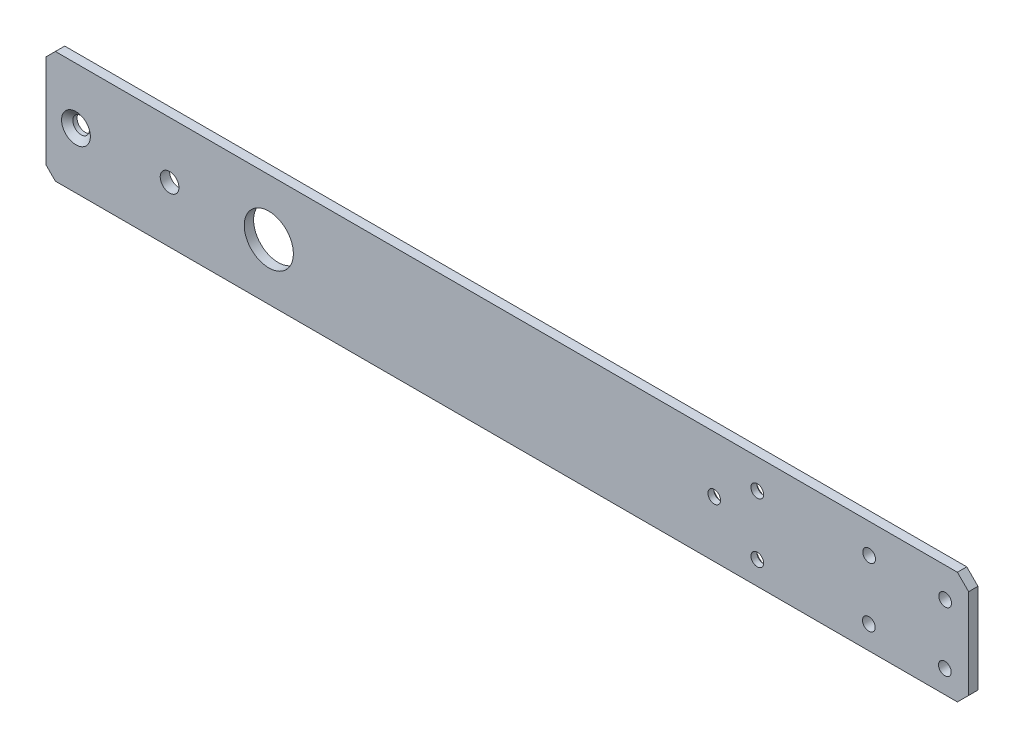
ISO-10303-21;
HEADER;
FILE_DESCRIPTION(('STEP AP214'),'2;1');
FILE_NAME('part.step','',(''),(''),'','','');
FILE_SCHEMA(('AUTOMOTIVE_DESIGN { 1 0 10303 214 1 1 1 1 }'));
ENDSEC;
DATA;
#1=APPLICATION_CONTEXT('core data for automotive mechanical design processes');
#2=APPLICATION_PROTOCOL_DEFINITION('international standard','automotive_design',2000,#1);
#3=PRODUCT_CONTEXT('',#1,'mechanical');
#4=PRODUCT('Part','Part','',(#3));
#5=PRODUCT_RELATED_PRODUCT_CATEGORY('part','',(#4));
#6=PRODUCT_DEFINITION_FORMATION('','',#4);
#7=PRODUCT_DEFINITION_CONTEXT('part definition',#1,'design');
#8=PRODUCT_DEFINITION('design','',#6,#7);
#9=PRODUCT_DEFINITION_SHAPE('','',#8);
#10=(LENGTH_UNIT() NAMED_UNIT(*) SI_UNIT(.MILLI.,.METRE.));
#11=(NAMED_UNIT(*) PLANE_ANGLE_UNIT() SI_UNIT($,.RADIAN.));
#12=(NAMED_UNIT(*) SI_UNIT($,.STERADIAN.) SOLID_ANGLE_UNIT());
#13=UNCERTAINTY_MEASURE_WITH_UNIT(LENGTH_MEASURE(1.E-05),#10,'distance_accuracy_value','');
#14=(GEOMETRIC_REPRESENTATION_CONTEXT(3) GLOBAL_UNCERTAINTY_ASSIGNED_CONTEXT((#13)) GLOBAL_UNIT_ASSIGNED_CONTEXT((#10,
#11,#12)) REPRESENTATION_CONTEXT('',''));
#15=CARTESIAN_POINT('',(0.,0.,0.));
#16=DIRECTION('',(0.,0.,1.));
#17=DIRECTION('',(1.,0.,0.));
#18=AXIS2_PLACEMENT_3D('',#15,#16,#17);
#19=CARTESIAN_POINT('',(0.,0.,1.5875));
#20=DIRECTION('',(0.,0.,-1.));
#21=DIRECTION('',(-1.,0.,0.));
#22=AXIS2_PLACEMENT_3D('',#19,#20,#21);
#23=PLANE('',#22);
#24=CARTESIAN_POINT('',(-33.6549999999997,0.,1.5875));
#25=DIRECTION('',(0.,0.,1.));
#26=DIRECTION('',(1.,0.,0.));
#27=AXIS2_PLACEMENT_3D('',#24,#25,#26);
#28=CIRCLE('',#27,3.175);
#29=CARTESIAN_POINT('',(-30.4799999999997,0.,1.5875));
#30=VERTEX_POINT('',#29);
#31=EDGE_CURVE('E236',#30,#30,#28,.T.);
#32=ORIENTED_EDGE('',*,*,#31,.F.);
#33=EDGE_LOOP('',(#32));
#34=FACE_BOUND('',#33,.T.);
#35=CARTESIAN_POINT('',(-65.4049999999997,0.,1.5875));
#36=DIRECTION('',(0.,0.,1.));
#37=DIRECTION('',(1.,0.,0.));
#38=AXIS2_PLACEMENT_3D('',#35,#36,#37);
#39=CIRCLE('',#38,4.8895);
#40=CARTESIAN_POINT('',(-60.5154999999997,0.,1.5875));
#41=VERTEX_POINT('',#40);
#42=EDGE_CURVE('E230',#41,#41,#39,.T.);
#43=ORIENTED_EDGE('',*,*,#42,.F.);
#44=EDGE_LOOP('',(#43));
#45=FACE_BOUND('',#44,.T.);
#46=CARTESIAN_POINT('',(229.388701470581,8.92379178362501,1.5875));
#47=DIRECTION('',(0.,0.,1.));
#48=DIRECTION('',(1.,0.,0.));
#49=AXIS2_PLACEMENT_3D('',#46,#47,#48);
#50=CIRCLE('',#49,2.15265000000001);
#51=CARTESIAN_POINT('',(231.541351470581,8.92379178362501,1.5875));
#52=VERTEX_POINT('',#51);
#53=EDGE_CURVE('E217',#52,#52,#50,.T.);
#54=ORIENTED_EDGE('',*,*,#53,.F.);
#55=EDGE_LOOP('',(#54));
#56=FACE_BOUND('',#55,.T.);
#57=CARTESIAN_POINT('',(229.282371238552,-11.3467989682312,1.5875));
#58=DIRECTION('',(0.,0.,1.));
#59=DIRECTION('',(1.,0.,0.));
#60=AXIS2_PLACEMENT_3D('',#57,#58,#59);
#61=CIRCLE('',#60,2.15265000000001);
#62=CARTESIAN_POINT('',(231.435021238552,-11.3467989682312,1.5875));
#63=VERTEX_POINT('',#62);
#64=EDGE_CURVE('E211',#63,#63,#61,.T.);
#65=ORIENTED_EDGE('',*,*,#64,.F.);
#66=EDGE_LOOP('',(#65));
#67=FACE_BOUND('',#66,.T.);
#68=CARTESIAN_POINT('',(203.503161764145,-11.1439269688226,1.5875));
#69=DIRECTION('',(0.,0.,1.));
#70=DIRECTION('',(1.,0.,0.));
#71=AXIS2_PLACEMENT_3D('',#68,#69,#70);
#72=CIRCLE('',#71,2.15265000000001);
#73=CARTESIAN_POINT('',(205.655811764145,-11.1439269688226,1.5875));
#74=VERTEX_POINT('',#73);
#75=EDGE_CURVE('E205',#74,#74,#72,.T.);
#76=ORIENTED_EDGE('',*,*,#75,.F.);
#77=EDGE_LOOP('',(#76));
#78=FACE_BOUND('',#77,.T.);
#79=CARTESIAN_POINT('',(203.608782335042,8.99137535087546,1.5875));
#80=DIRECTION('',(0.,0.,1.));
#81=DIRECTION('',(1.,0.,0.));
#82=AXIS2_PLACEMENT_3D('',#79,#80,#81);
#83=CIRCLE('',#82,2.15265000000001);
#84=CARTESIAN_POINT('',(205.761432335042,8.99137535087546,1.5875));
#85=VERTEX_POINT('',#84);
#86=EDGE_CURVE('E199',#85,#85,#83,.T.);
#87=ORIENTED_EDGE('',*,*,#86,.F.);
#88=EDGE_LOOP('',(#87));
#89=FACE_BOUND('',#88,.T.);
#90=CARTESIAN_POINT('',(165.672159691472,8.99137535087546,1.5875));
#91=DIRECTION('',(0.,0.,1.));
#92=DIRECTION('',(1.,0.,0.));
#93=AXIS2_PLACEMENT_3D('',#90,#91,#92);
#94=CIRCLE('',#93,2.15265000000001);
#95=CARTESIAN_POINT('',(167.824809691472,8.99137535087546,1.5875));
#96=VERTEX_POINT('',#95);
#97=EDGE_CURVE('E192',#96,#96,#94,.T.);
#98=ORIENTED_EDGE('',*,*,#97,.F.);
#99=EDGE_LOOP('',(#98));
#100=FACE_BOUND('',#99,.T.);
#101=CARTESIAN_POINT('',(165.672159691472,-11.1439269688226,1.5875));
#102=DIRECTION('',(0.,0.,1.));
#103=DIRECTION('',(1.,0.,0.));
#104=AXIS2_PLACEMENT_3D('',#101,#102,#103);
#105=CIRCLE('',#104,2.15265000000001);
#106=CARTESIAN_POINT('',(167.824809691472,-11.1439269688226,1.5875));
#107=VERTEX_POINT('',#106);
#108=EDGE_CURVE('E188',#107,#107,#105,.T.);
#109=ORIENTED_EDGE('',*,*,#108,.F.);
#110=EDGE_LOOP('',(#109));
#111=FACE_BOUND('',#110,.T.);
#112=CARTESIAN_POINT('',(151.067159691472,0.,1.5875));
#113=DIRECTION('',(0.,0.,1.));
#114=DIRECTION('',(1.,0.,0.));
#115=AXIS2_PLACEMENT_3D('',#112,#113,#114);
#116=CIRCLE('',#115,2.15265000000001);
#117=CARTESIAN_POINT('',(153.219809691472,0.,1.5875));
#118=VERTEX_POINT('',#117);
#119=EDGE_CURVE('E182',#118,#118,#116,.T.);
#120=ORIENTED_EDGE('',*,*,#119,.F.);
#121=EDGE_LOOP('',(#120));
#122=FACE_BOUND('',#121,.T.);
#123=DIRECTION('',(0.,-1.,0.));
#124=VECTOR('',#123,1.);
#125=CARTESIAN_POINT('',(-75.5649999999997,-19.05,1.5875));
#126=LINE('',#125,#124);
#127=CARTESIAN_POINT('',(-75.5649999999997,15.875,1.5875));
#128=VERTEX_POINT('',#127);
#129=CARTESIAN_POINT('',(-75.5649999999997,-15.875,1.5875));
#130=VERTEX_POINT('',#129);
#131=EDGE_CURVE('E169',#128,#130,#126,.T.);
#132=ORIENTED_EDGE('',*,*,#131,.T.);
#133=DIRECTION('',(0.707106781186544,-0.707106781186551,0.));
#134=VECTOR('',#133,1.);
#135=CARTESIAN_POINT('',(-75.5649999999997,-15.875,1.5875));
#136=LINE('',#135,#134);
#137=CARTESIAN_POINT('',(-72.3899999999996,-19.05,1.5875));
#138=VERTEX_POINT('',#137);
#139=EDGE_CURVE('E156',#130,#138,#136,.T.);
#140=ORIENTED_EDGE('',*,*,#139,.T.);
#141=DIRECTION('',(1.,0.,0.));
#142=VECTOR('',#141,1.);
#143=CARTESIAN_POINT('',(-28.5749999999997,-19.05,1.5875));
#144=LINE('',#143,#142);
#145=CARTESIAN_POINT('',(233.542085197356,-19.05,1.5875));
#146=VERTEX_POINT('',#145);
#147=EDGE_CURVE('E134',#138,#146,#144,.T.);
#148=ORIENTED_EDGE('',*,*,#147,.T.);
#149=DIRECTION('',(-0.707106781186548,-0.707106781186547,0.));
#150=VECTOR('',#149,1.);
#151=CARTESIAN_POINT('',(233.542085197356,-19.05,1.5875));
#152=LINE('',#151,#150);
#153=CARTESIAN_POINT('',(237.352085197356,-15.24,1.5875));
#154=VERTEX_POINT('',#153);
#155=EDGE_CURVE('E129',#146,#154,#152,.F.);
#156=ORIENTED_EDGE('',*,*,#155,.T.);
#157=DIRECTION('',(0.,-1.,0.));
#158=VECTOR('',#157,1.);
#159=CARTESIAN_POINT('',(237.352085197356,19.0500000000001,1.5875));
#160=LINE('',#159,#158);
#161=CARTESIAN_POINT('',(237.352085197356,15.24,1.5875));
#162=VERTEX_POINT('',#161);
#163=EDGE_CURVE('E168',#162,#154,#160,.T.);
#164=ORIENTED_EDGE('',*,*,#163,.F.);
#165=DIRECTION('',(0.707106781186547,-0.707106781186548,0.));
#166=VECTOR('',#165,1.);
#167=CARTESIAN_POINT('',(237.352085197356,15.24,1.5875));
#168=LINE('',#167,#166);
#169=CARTESIAN_POINT('',(233.542085197356,19.0500000000001,1.5875));
#170=VERTEX_POINT('',#169);
#171=EDGE_CURVE('E140',#162,#170,#168,.F.);
#172=ORIENTED_EDGE('',*,*,#171,.T.);
#173=DIRECTION('',(-1.,0.,0.));
#174=VECTOR('',#173,1.);
#175=CARTESIAN_POINT('',(0.,19.05,1.5875));
#176=LINE('',#175,#174);
#177=CARTESIAN_POINT('',(-72.3899999999997,19.05,1.5875));
#178=VERTEX_POINT('',#177);
#179=EDGE_CURVE('E130',#170,#178,#176,.T.);
#180=ORIENTED_EDGE('',*,*,#179,.T.);
#181=DIRECTION('',(-0.707106781186548,-0.707106781186548,0.));
#182=VECTOR('',#181,1.);
#183=CARTESIAN_POINT('',(-72.3899999999997,19.05,1.5875));
#184=LINE('',#183,#182);
#185=EDGE_CURVE('E154',#178,#128,#184,.T.);
#186=ORIENTED_EDGE('',*,*,#185,.T.);
#187=EDGE_LOOP('',(#132,#140,#148,#156,#164,#172,#180,#186));
#188=FACE_BOUND('',#187,.T.);
#189=CARTESIAN_POINT('',(0.,0.,1.5875));
#190=DIRECTION('',(0.,0.,1.));
#191=DIRECTION('',(1.,0.,0.));
#192=AXIS2_PLACEMENT_3D('',#189,#190,#191);
#193=CIRCLE('',#192,8.334375);
#194=CARTESIAN_POINT('',(8.334375,0.,1.5875));
#195=VERTEX_POINT('',#194);
#196=EDGE_CURVE('E114',#195,#195,#193,.T.);
#197=ORIENTED_EDGE('',*,*,#196,.F.);
#198=EDGE_LOOP('',(#197));
#199=FACE_BOUND('',#198,.T.);
#200=ADVANCED_FACE('F40',(#34,#45,#56,#67,#78,#89,#100,#111,#122,#188,#199),#23,.F.);
#201=CARTESIAN_POINT('',(0.,0.,-1.5875));
#202=DIRECTION('',(0.,0.,-1.));
#203=DIRECTION('',(-1.,0.,0.));
#204=AXIS2_PLACEMENT_3D('',#201,#202,#203);
#205=PLANE('',#204);
#206=CARTESIAN_POINT('',(151.067159691472,1.11022302462516E-13,-1.5875));
#207=DIRECTION('',(0.,0.,-1.));
#208=DIRECTION('',(-1.,0.,0.));
#209=AXIS2_PLACEMENT_3D('',#206,#207,#208);
#210=CIRCLE('',#209,3.5433);
#211=CARTESIAN_POINT('',(147.523859691472,1.11022302462516E-13,-1.5875));
#212=VERTEX_POINT('',#211);
#213=EDGE_CURVE('E258',#212,#212,#210,.T.);
#214=ORIENTED_EDGE('',*,*,#213,.F.);
#215=EDGE_LOOP('',(#214));
#216=FACE_BOUND('',#215,.T.);
#217=CARTESIAN_POINT('',(165.672159691472,-11.1439269688225,-1.5875));
#218=DIRECTION('',(0.,0.,-1.));
#219=DIRECTION('',(-1.,0.,0.));
#220=AXIS2_PLACEMENT_3D('',#217,#218,#219);
#221=CIRCLE('',#220,3.5433);
#222=CARTESIAN_POINT('',(162.128859691472,-11.1439269688225,-1.5875));
#223=VERTEX_POINT('',#222);
#224=EDGE_CURVE('E251',#223,#223,#221,.T.);
#225=ORIENTED_EDGE('',*,*,#224,.F.);
#226=EDGE_LOOP('',(#225));
#227=FACE_BOUND('',#226,.T.);
#228=CARTESIAN_POINT('',(165.672159691472,8.99137535087546,-1.5875));
#229=DIRECTION('',(0.,0.,-1.));
#230=DIRECTION('',(-1.,0.,0.));
#231=AXIS2_PLACEMENT_3D('',#228,#229,#230);
#232=CIRCLE('',#231,3.5433);
#233=CARTESIAN_POINT('',(162.128859691472,8.99137535087546,-1.5875));
#234=VERTEX_POINT('',#233);
#235=EDGE_CURVE('E243',#234,#234,#232,.T.);
#236=ORIENTED_EDGE('',*,*,#235,.F.);
#237=EDGE_LOOP('',(#236));
#238=FACE_BOUND('',#237,.T.);
#239=CARTESIAN_POINT('',(-33.6549999999997,0.,-1.5875));
#240=DIRECTION('',(0.,0.,1.));
#241=DIRECTION('',(1.,0.,0.));
#242=AXIS2_PLACEMENT_3D('',#239,#240,#241);
#243=CIRCLE('',#242,3.175);
#244=CARTESIAN_POINT('',(-30.4799999999997,0.,-1.5875));
#245=VERTEX_POINT('',#244);
#246=EDGE_CURVE('E233',#245,#245,#243,.T.);
#247=ORIENTED_EDGE('',*,*,#246,.T.);
#248=EDGE_LOOP('',(#247));
#249=FACE_BOUND('',#248,.T.);
#250=CARTESIAN_POINT('',(-65.4049999999997,0.,-1.5875));
#251=DIRECTION('',(0.,0.,1.));
#252=DIRECTION('',(1.,0.,0.));
#253=AXIS2_PLACEMENT_3D('',#250,#251,#252);
#254=CIRCLE('',#253,2.8067);
#255=CARTESIAN_POINT('',(-62.5982999999997,0.,-1.5875));
#256=VERTEX_POINT('',#255);
#257=EDGE_CURVE('E223',#256,#256,#254,.T.);
#258=ORIENTED_EDGE('',*,*,#257,.T.);
#259=EDGE_LOOP('',(#258));
#260=FACE_BOUND('',#259,.T.);
#261=DIRECTION('',(1.,0.,0.));
#262=VECTOR('',#261,1.);
#263=CARTESIAN_POINT('',(0.,-19.05,-1.5875));
#264=LINE('',#263,#262);
#265=CARTESIAN_POINT('',(-72.3899999999997,-19.05,-1.5875));
#266=VERTEX_POINT('',#265);
#267=CARTESIAN_POINT('',(233.542085197356,-19.05,-1.5875));
#268=VERTEX_POINT('',#267);
#269=EDGE_CURVE('E106',#266,#268,#264,.T.);
#270=ORIENTED_EDGE('',*,*,#269,.F.);
#271=DIRECTION('',(-0.707106781186544,0.707106781186551,0.));
#272=VECTOR('',#271,1.);
#273=CARTESIAN_POINT('',(-45.7200000000001,-45.7199999999998,-1.5875));
#274=LINE('',#273,#272);
#275=CARTESIAN_POINT('',(-75.5649999999997,-15.875,-1.5875));
#276=VERTEX_POINT('',#275);
#277=EDGE_CURVE('E48',#266,#276,#274,.T.);
#278=ORIENTED_EDGE('',*,*,#277,.T.);
#279=DIRECTION('',(0.,-1.,0.));
#280=VECTOR('',#279,1.);
#281=CARTESIAN_POINT('',(-75.5649999999997,-19.05,-1.5875));
#282=LINE('',#281,#280);
#283=CARTESIAN_POINT('',(-75.5649999999997,15.875,-1.5875));
#284=VERTEX_POINT('',#283);
#285=EDGE_CURVE('E160',#284,#276,#282,.T.);
#286=ORIENTED_EDGE('',*,*,#285,.F.);
#287=DIRECTION('',(0.707106781186548,0.707106781186548,0.));
#288=VECTOR('',#287,1.);
#289=CARTESIAN_POINT('',(-45.7199999999998,45.7199999999998,-1.5875));
#290=LINE('',#289,#288);
#291=CARTESIAN_POINT('',(-72.3899999999997,19.05,-1.5875));
#292=VERTEX_POINT('',#291);
#293=EDGE_CURVE('E55',#284,#292,#290,.T.);
#294=ORIENTED_EDGE('',*,*,#293,.T.);
#295=DIRECTION('',(-1.,0.,0.));
#296=VECTOR('',#295,1.);
#297=CARTESIAN_POINT('',(0.,19.05,-1.5875));
#298=LINE('',#297,#296);
#299=CARTESIAN_POINT('',(233.542085197356,19.0500000000001,-1.5875));
#300=VERTEX_POINT('',#299);
#301=EDGE_CURVE('E113',#300,#292,#298,.T.);
#302=ORIENTED_EDGE('',*,*,#301,.F.);
#303=DIRECTION('',(-0.707106781186547,0.707106781186548,0.));
#304=VECTOR('',#303,1.);
#305=CARTESIAN_POINT('',(126.296042598678,126.296042598678,-1.5875));
#306=LINE('',#305,#304);
#307=CARTESIAN_POINT('',(237.352085197356,15.24,-1.5875));
#308=VERTEX_POINT('',#307);
#309=EDGE_CURVE('E125',#300,#308,#306,.F.);
#310=ORIENTED_EDGE('',*,*,#309,.T.);
#311=DIRECTION('',(0.,-1.,0.));
#312=VECTOR('',#311,1.);
#313=CARTESIAN_POINT('',(237.352085197356,19.0500000000001,-1.5875));
#314=LINE('',#313,#312);
#315=CARTESIAN_POINT('',(237.352085197356,-15.24,-1.5875));
#316=VERTEX_POINT('',#315);
#317=EDGE_CURVE('E122',#308,#316,#314,.T.);
#318=ORIENTED_EDGE('',*,*,#317,.T.);
#319=DIRECTION('',(0.707106781186548,0.707106781186547,0.));
#320=VECTOR('',#319,1.);
#321=CARTESIAN_POINT('',(126.296042598678,-126.296042598678,-1.5875));
#322=LINE('',#321,#320);
#323=EDGE_CURVE('E118',#316,#268,#322,.F.);
#324=ORIENTED_EDGE('',*,*,#323,.T.);
#325=EDGE_LOOP('',(#270,#278,#286,#294,#302,#310,#318,#324));
#326=FACE_BOUND('',#325,.T.);
#327=CARTESIAN_POINT('',(229.388701470581,8.92379178362501,-1.5875));
#328=DIRECTION('',(0.,0.,1.));
#329=DIRECTION('',(1.,0.,0.));
#330=AXIS2_PLACEMENT_3D('',#327,#328,#329);
#331=CIRCLE('',#330,2.15265000000001);
#332=CARTESIAN_POINT('',(231.541351470581,8.92379178362501,-1.5875));
#333=VERTEX_POINT('',#332);
#334=EDGE_CURVE('E214',#333,#333,#331,.T.);
#335=ORIENTED_EDGE('',*,*,#334,.T.);
#336=EDGE_LOOP('',(#335));
#337=FACE_BOUND('',#336,.T.);
#338=CARTESIAN_POINT('',(229.282371238552,-11.3467989682312,-1.5875));
#339=DIRECTION('',(0.,0.,1.));
#340=DIRECTION('',(1.,0.,0.));
#341=AXIS2_PLACEMENT_3D('',#338,#339,#340);
#342=CIRCLE('',#341,2.15265000000001);
#343=CARTESIAN_POINT('',(231.435021238552,-11.3467989682312,-1.5875));
#344=VERTEX_POINT('',#343);
#345=EDGE_CURVE('E208',#344,#344,#342,.T.);
#346=ORIENTED_EDGE('',*,*,#345,.T.);
#347=EDGE_LOOP('',(#346));
#348=FACE_BOUND('',#347,.T.);
#349=CARTESIAN_POINT('',(203.503161764145,-11.1439269688226,-1.5875));
#350=DIRECTION('',(0.,0.,1.));
#351=DIRECTION('',(1.,0.,0.));
#352=AXIS2_PLACEMENT_3D('',#349,#350,#351);
#353=CIRCLE('',#352,2.15265000000001);
#354=CARTESIAN_POINT('',(205.655811764145,-11.1439269688226,-1.5875));
#355=VERTEX_POINT('',#354);
#356=EDGE_CURVE('E202',#355,#355,#353,.T.);
#357=ORIENTED_EDGE('',*,*,#356,.T.);
#358=EDGE_LOOP('',(#357));
#359=FACE_BOUND('',#358,.T.);
#360=CARTESIAN_POINT('',(203.608782335042,8.99137535087546,-1.5875));
#361=DIRECTION('',(0.,0.,1.));
#362=DIRECTION('',(1.,0.,0.));
#363=AXIS2_PLACEMENT_3D('',#360,#361,#362);
#364=CIRCLE('',#363,2.15265000000001);
#365=CARTESIAN_POINT('',(205.761432335042,8.99137535087546,-1.5875));
#366=VERTEX_POINT('',#365);
#367=EDGE_CURVE('E196',#366,#366,#364,.T.);
#368=ORIENTED_EDGE('',*,*,#367,.T.);
#369=EDGE_LOOP('',(#368));
#370=FACE_BOUND('',#369,.T.);
#371=CARTESIAN_POINT('',(0.,0.,-1.5875));
#372=DIRECTION('',(0.,0.,1.));
#373=DIRECTION('',(1.,0.,0.));
#374=AXIS2_PLACEMENT_3D('',#371,#372,#373);
#375=CIRCLE('',#374,8.334375);
#376=CARTESIAN_POINT('',(8.334375,0.,-1.5875));
#377=VERTEX_POINT('',#376);
#378=EDGE_CURVE('E179',#377,#377,#375,.T.);
#379=ORIENTED_EDGE('',*,*,#378,.T.);
#380=EDGE_LOOP('',(#379));
#381=FACE_BOUND('',#380,.T.);
#382=ADVANCED_FACE('F119',(#216,#227,#238,#249,#260,#326,#337,#348,#359,#370,#381),#205,.T.);
#383=CARTESIAN_POINT('',(0.,-19.05,1.5875));
#384=DIRECTION('',(0.,1.,0.));
#385=DIRECTION('',(0.,0.,1.));
#386=AXIS2_PLACEMENT_3D('',#383,#384,#385);
#387=PLANE('',#386);
#388=ORIENTED_EDGE('',*,*,#147,.F.);
#389=DIRECTION('',(0.,0.,-1.));
#390=VECTOR('',#389,1.);
#391=CARTESIAN_POINT('',(-72.3899999999997,-19.05,-1.5875));
#392=LINE('',#391,#390);
#393=EDGE_CURVE('E63',#138,#266,#392,.T.);
#394=ORIENTED_EDGE('',*,*,#393,.T.);
#395=ORIENTED_EDGE('',*,*,#269,.T.);
#396=DIRECTION('',(0.,0.,1.));
#397=VECTOR('',#396,1.);
#398=CARTESIAN_POINT('',(233.542085197356,-19.05,1.5875));
#399=LINE('',#398,#397);
#400=EDGE_CURVE('E110',#268,#146,#399,.T.);
#401=ORIENTED_EDGE('',*,*,#400,.T.);
#402=EDGE_LOOP('',(#388,#394,#395,#401));
#403=FACE_BOUND('',#402,.T.);
#404=ADVANCED_FACE('F108',(#403),#387,.F.);
#405=CARTESIAN_POINT('',(0.,19.05,1.5875));
#406=DIRECTION('',(0.,-1.,0.));
#407=DIRECTION('',(1.,0.,0.));
#408=AXIS2_PLACEMENT_3D('',#405,#406,#407);
#409=PLANE('',#408);
#410=ORIENTED_EDGE('',*,*,#301,.T.);
#411=DIRECTION('',(0.,0.,1.));
#412=VECTOR('',#411,1.);
#413=CARTESIAN_POINT('',(-72.3899999999997,19.05,1.5875));
#414=LINE('',#413,#412);
#415=EDGE_CURVE('E11',#292,#178,#414,.T.);
#416=ORIENTED_EDGE('',*,*,#415,.T.);
#417=ORIENTED_EDGE('',*,*,#179,.F.);
#418=DIRECTION('',(0.,0.,-1.));
#419=VECTOR('',#418,1.);
#420=CARTESIAN_POINT('',(233.542085197356,19.0500000000001,1.5875));
#421=LINE('',#420,#419);
#422=EDGE_CURVE('E142',#170,#300,#421,.T.);
#423=ORIENTED_EDGE('',*,*,#422,.T.);
#424=EDGE_LOOP('',(#410,#416,#417,#423));
#425=FACE_BOUND('',#424,.T.);
#426=ADVANCED_FACE('F320',(#425),#409,.F.);
#427=CARTESIAN_POINT('',(0.,0.,1.5875));
#428=DIRECTION('',(0.,0.,-1.));
#429=DIRECTION('',(-1.,0.,0.));
#430=AXIS2_PLACEMENT_3D('',#427,#428,#429);
#431=CYLINDRICAL_SURFACE('',#430,8.334375);
#432=ORIENTED_EDGE('',*,*,#196,.T.);
#433=EDGE_LOOP('',(#432));
#434=FACE_BOUND('',#433,.T.);
#435=ORIENTED_EDGE('',*,*,#378,.F.);
#436=EDGE_LOOP('',(#435));
#437=FACE_BOUND('',#436,.T.);
#438=ADVANCED_FACE('F310',(#434,#437),#431,.F.);
#439=CARTESIAN_POINT('',(151.067159691472,0.,1.5875));
#440=DIRECTION('',(0.,0.,1.));
#441=DIRECTION('',(1.,0.,0.));
#442=AXIS2_PLACEMENT_3D('',#439,#440,#441);
#443=CYLINDRICAL_SURFACE('',#442,2.15265000000001);
#444=CARTESIAN_POINT('',(151.067159691472,1.11022302462516E-13,-0.420606097903314));
#445=DIRECTION('',(0.,0.,-1.));
#446=DIRECTION('',(-1.,0.,0.));
#447=AXIS2_PLACEMENT_3D('',#444,#445,#446);
#448=CIRCLE('',#447,2.15265000000001);
#449=CARTESIAN_POINT('',(148.914509691472,1.11022302462516E-13,-0.420606097903314));
#450=VERTEX_POINT('',#449);
#451=EDGE_CURVE('E254',#450,#450,#448,.T.);
#452=ORIENTED_EDGE('',*,*,#451,.T.);
#453=EDGE_LOOP('',(#452));
#454=FACE_BOUND('',#453,.T.);
#455=ORIENTED_EDGE('',*,*,#119,.T.);
#456=EDGE_LOOP('',(#455));
#457=FACE_BOUND('',#456,.T.);
#458=ADVANCED_FACE('F307',(#454,#457),#443,.F.);
#459=CARTESIAN_POINT('',(165.672159691472,-11.1439269688226,1.5875));
#460=DIRECTION('',(0.,0.,1.));
#461=DIRECTION('',(1.,0.,0.));
#462=AXIS2_PLACEMENT_3D('',#459,#460,#461);
#463=CYLINDRICAL_SURFACE('',#462,2.15265000000001);
#464=CARTESIAN_POINT('',(165.672159691472,-11.1439269688225,-0.420606097903314));
#465=DIRECTION('',(0.,0.,-1.));
#466=DIRECTION('',(-1.,0.,0.));
#467=AXIS2_PLACEMENT_3D('',#464,#465,#466);
#468=CIRCLE('',#467,2.15265000000001);
#469=CARTESIAN_POINT('',(163.519509691472,-11.1439269688225,-0.420606097903314));
#470=VERTEX_POINT('',#469);
#471=EDGE_CURVE('E247',#470,#470,#468,.T.);
#472=ORIENTED_EDGE('',*,*,#471,.T.);
#473=EDGE_LOOP('',(#472));
#474=FACE_BOUND('',#473,.T.);
#475=ORIENTED_EDGE('',*,*,#108,.T.);
#476=EDGE_LOOP('',(#475));
#477=FACE_BOUND('',#476,.T.);
#478=ADVANCED_FACE('F309',(#474,#477),#463,.F.);
#479=CARTESIAN_POINT('',(165.672159691472,8.99137535087546,1.5875));
#480=DIRECTION('',(0.,0.,1.));
#481=DIRECTION('',(1.,0.,0.));
#482=AXIS2_PLACEMENT_3D('',#479,#480,#481);
#483=CYLINDRICAL_SURFACE('',#482,2.15265000000001);
#484=CARTESIAN_POINT('',(165.672159691472,8.99137535087546,-0.420606097903314));
#485=DIRECTION('',(0.,0.,-1.));
#486=DIRECTION('',(-1.,0.,0.));
#487=AXIS2_PLACEMENT_3D('',#484,#485,#486);
#488=CIRCLE('',#487,2.15265000000001);
#489=CARTESIAN_POINT('',(163.519509691472,8.99137535087546,-0.420606097903314));
#490=VERTEX_POINT('',#489);
#491=EDGE_CURVE('E239',#490,#490,#488,.T.);
#492=ORIENTED_EDGE('',*,*,#491,.T.);
#493=EDGE_LOOP('',(#492));
#494=FACE_BOUND('',#493,.T.);
#495=ORIENTED_EDGE('',*,*,#97,.T.);
#496=EDGE_LOOP('',(#495));
#497=FACE_BOUND('',#496,.T.);
#498=ADVANCED_FACE('F317',(#494,#497),#483,.F.);
#499=CARTESIAN_POINT('',(203.608782335042,8.99137535087546,1.5875));
#500=DIRECTION('',(0.,0.,1.));
#501=DIRECTION('',(1.,0.,0.));
#502=AXIS2_PLACEMENT_3D('',#499,#500,#501);
#503=CYLINDRICAL_SURFACE('',#502,2.15265000000001);
#504=ORIENTED_EDGE('',*,*,#367,.F.);
#505=EDGE_LOOP('',(#504));
#506=FACE_BOUND('',#505,.T.);
#507=ORIENTED_EDGE('',*,*,#86,.T.);
#508=EDGE_LOOP('',(#507));
#509=FACE_BOUND('',#508,.T.);
#510=ADVANCED_FACE('F360',(#506,#509),#503,.F.);
#511=CARTESIAN_POINT('',(203.503161764145,-11.1439269688226,1.5875));
#512=DIRECTION('',(0.,0.,1.));
#513=DIRECTION('',(1.,0.,0.));
#514=AXIS2_PLACEMENT_3D('',#511,#512,#513);
#515=CYLINDRICAL_SURFACE('',#514,2.15265000000001);
#516=ORIENTED_EDGE('',*,*,#356,.F.);
#517=EDGE_LOOP('',(#516));
#518=FACE_BOUND('',#517,.T.);
#519=ORIENTED_EDGE('',*,*,#75,.T.);
#520=EDGE_LOOP('',(#519));
#521=FACE_BOUND('',#520,.T.);
#522=ADVANCED_FACE('F356',(#518,#521),#515,.F.);
#523=CARTESIAN_POINT('',(229.282371238552,-11.3467989682312,1.5875));
#524=DIRECTION('',(0.,0.,1.));
#525=DIRECTION('',(1.,0.,0.));
#526=AXIS2_PLACEMENT_3D('',#523,#524,#525);
#527=CYLINDRICAL_SURFACE('',#526,2.15265000000001);
#528=ORIENTED_EDGE('',*,*,#345,.F.);
#529=EDGE_LOOP('',(#528));
#530=FACE_BOUND('',#529,.T.);
#531=ORIENTED_EDGE('',*,*,#64,.T.);
#532=EDGE_LOOP('',(#531));
#533=FACE_BOUND('',#532,.T.);
#534=ADVANCED_FACE('F352',(#530,#533),#527,.F.);
#535=CARTESIAN_POINT('',(229.388701470581,8.92379178362501,1.5875));
#536=DIRECTION('',(0.,0.,1.));
#537=DIRECTION('',(1.,0.,0.));
#538=AXIS2_PLACEMENT_3D('',#535,#536,#537);
#539=CYLINDRICAL_SURFACE('',#538,2.15265000000001);
#540=ORIENTED_EDGE('',*,*,#334,.F.);
#541=EDGE_LOOP('',(#540));
#542=FACE_BOUND('',#541,.T.);
#543=ORIENTED_EDGE('',*,*,#53,.T.);
#544=EDGE_LOOP('',(#543));
#545=FACE_BOUND('',#544,.T.);
#546=ADVANCED_FACE('F348',(#542,#545),#539,.F.);
#547=CARTESIAN_POINT('',(237.352085197356,19.0500000000001,-1.5875));
#548=DIRECTION('',(-1.,0.,0.));
#549=DIRECTION('',(0.,-1.,0.));
#550=AXIS2_PLACEMENT_3D('',#547,#548,#549);
#551=PLANE('',#550);
#552=ORIENTED_EDGE('',*,*,#317,.F.);
#553=DIRECTION('',(0.,0.,1.));
#554=VECTOR('',#553,1.);
#555=CARTESIAN_POINT('',(237.352085197356,15.24,-1.5875));
#556=LINE('',#555,#554);
#557=EDGE_CURVE('E146',#308,#162,#556,.T.);
#558=ORIENTED_EDGE('',*,*,#557,.T.);
#559=ORIENTED_EDGE('',*,*,#163,.T.);
#560=DIRECTION('',(0.,0.,-1.));
#561=VECTOR('',#560,1.);
#562=CARTESIAN_POINT('',(237.352085197356,-15.24,-1.5875));
#563=LINE('',#562,#561);
#564=EDGE_CURVE('E144',#154,#316,#563,.T.);
#565=ORIENTED_EDGE('',*,*,#564,.T.);
#566=EDGE_LOOP('',(#552,#558,#559,#565));
#567=FACE_BOUND('',#566,.T.);
#568=ADVANCED_FACE('F333',(#567),#551,.F.);
#569=CARTESIAN_POINT('',(237.352085197356,15.24,-1.5875));
#570=DIRECTION('',(-0.707106781186548,-0.707106781186547,0.));
#571=DIRECTION('',(0.,0.,1.));
#572=AXIS2_PLACEMENT_3D('',#569,#570,#571);
#573=PLANE('',#572);
#574=ORIENTED_EDGE('',*,*,#309,.F.);
#575=ORIENTED_EDGE('',*,*,#422,.F.);
#576=ORIENTED_EDGE('',*,*,#171,.F.);
#577=ORIENTED_EDGE('',*,*,#557,.F.);
#578=EDGE_LOOP('',(#574,#575,#576,#577));
#579=FACE_BOUND('',#578,.T.);
#580=ADVANCED_FACE('F330',(#579),#573,.F.);
#581=CARTESIAN_POINT('',(233.542085197356,-19.05,1.5875));
#582=DIRECTION('',(-0.707106781186547,0.707106781186548,0.));
#583=DIRECTION('',(0.,0.,1.));
#584=AXIS2_PLACEMENT_3D('',#581,#582,#583);
#585=PLANE('',#584);
#586=ORIENTED_EDGE('',*,*,#323,.F.);
#587=ORIENTED_EDGE('',*,*,#564,.F.);
#588=ORIENTED_EDGE('',*,*,#155,.F.);
#589=ORIENTED_EDGE('',*,*,#400,.F.);
#590=EDGE_LOOP('',(#586,#587,#588,#589));
#591=FACE_BOUND('',#590,.T.);
#592=ADVANCED_FACE('F128',(#591),#585,.F.);
#593=CARTESIAN_POINT('',(-75.5649999999997,-19.05,-1.5875));
#594=DIRECTION('',(-1.,0.,0.));
#595=DIRECTION('',(0.,0.,1.));
#596=AXIS2_PLACEMENT_3D('',#593,#594,#595);
#597=PLANE('',#596);
#598=ORIENTED_EDGE('',*,*,#285,.T.);
#599=DIRECTION('',(0.,0.,1.));
#600=VECTOR('',#599,1.);
#601=CARTESIAN_POINT('',(-75.5649999999997,-15.875,1.5875));
#602=LINE('',#601,#600);
#603=EDGE_CURVE('E151',#276,#130,#602,.T.);
#604=ORIENTED_EDGE('',*,*,#603,.T.);
#605=ORIENTED_EDGE('',*,*,#131,.F.);
#606=DIRECTION('',(0.,0.,-1.));
#607=VECTOR('',#606,1.);
#608=CARTESIAN_POINT('',(-75.5649999999997,15.875,-1.5875));
#609=LINE('',#608,#607);
#610=EDGE_CURVE('E149',#128,#284,#609,.T.);
#611=ORIENTED_EDGE('',*,*,#610,.T.);
#612=EDGE_LOOP('',(#598,#604,#605,#611));
#613=FACE_BOUND('',#612,.T.);
#614=ADVANCED_FACE('F164',(#613),#597,.T.);
#615=CARTESIAN_POINT('',(-75.5649999999997,-15.875,-1.5875));
#616=DIRECTION('',(-0.707106781186551,-0.707106781186544,0.));
#617=DIRECTION('',(0.,0.,-1.));
#618=AXIS2_PLACEMENT_3D('',#615,#616,#617);
#619=PLANE('',#618);
#620=ORIENTED_EDGE('',*,*,#277,.F.);
#621=ORIENTED_EDGE('',*,*,#393,.F.);
#622=ORIENTED_EDGE('',*,*,#139,.F.);
#623=ORIENTED_EDGE('',*,*,#603,.F.);
#624=EDGE_LOOP('',(#620,#621,#622,#623));
#625=FACE_BOUND('',#624,.T.);
#626=ADVANCED_FACE('F171',(#625),#619,.T.);
#627=CARTESIAN_POINT('',(-72.3899999999997,19.05,1.5875));
#628=DIRECTION('',(-0.707106781186548,0.707106781186548,0.));
#629=DIRECTION('',(0.,0.,-1.));
#630=AXIS2_PLACEMENT_3D('',#627,#628,#629);
#631=PLANE('',#630);
#632=ORIENTED_EDGE('',*,*,#293,.F.);
#633=ORIENTED_EDGE('',*,*,#610,.F.);
#634=ORIENTED_EDGE('',*,*,#185,.F.);
#635=ORIENTED_EDGE('',*,*,#415,.F.);
#636=EDGE_LOOP('',(#632,#633,#634,#635));
#637=FACE_BOUND('',#636,.T.);
#638=ADVANCED_FACE('F42',(#637),#631,.T.);
#639=CARTESIAN_POINT('',(-65.4049999999997,0.,1.5875));
#640=DIRECTION('',(0.,0.,1.));
#641=DIRECTION('',(1.,0.,0.));
#642=AXIS2_PLACEMENT_3D('',#639,#640,#641);
#643=CYLINDRICAL_SURFACE('',#642,2.80669999999999);
#644=ORIENTED_EDGE('',*,*,#257,.F.);
#645=EDGE_LOOP('',(#644));
#646=FACE_BOUND('',#645,.T.);
#647=CARTESIAN_POINT('',(-65.4049999999997,0.,-0.16017671181604));
#648=DIRECTION('',(0.,0.,1.));
#649=DIRECTION('',(1.,0.,0.));
#650=AXIS2_PLACEMENT_3D('',#647,#648,#649);
#651=CIRCLE('',#650,2.80669999999998);
#652=CARTESIAN_POINT('',(-62.5982999999997,0.,-0.16017671181604));
#653=VERTEX_POINT('',#652);
#654=EDGE_CURVE('E227',#653,#653,#651,.T.);
#655=ORIENTED_EDGE('',*,*,#654,.T.);
#656=EDGE_LOOP('',(#655));
#657=FACE_BOUND('',#656,.T.);
#658=ADVANCED_FACE('F276',(#646,#657),#643,.F.);
#659=CARTESIAN_POINT('',(-65.4049999999997,0.,1.5875));
#660=DIRECTION('',(0.,0.,1.));
#661=DIRECTION('',(1.,0.,0.));
#662=AXIS2_PLACEMENT_3D('',#659,#660,#661);
#663=CONICAL_SURFACE('',#662,4.8895,0.872664625997168);
#664=ORIENTED_EDGE('',*,*,#654,.F.);
#665=EDGE_LOOP('',(#664));
#666=FACE_BOUND('',#665,.T.);
#667=ORIENTED_EDGE('',*,*,#42,.T.);
#668=EDGE_LOOP('',(#667));
#669=FACE_BOUND('',#668,.T.);
#670=ADVANCED_FACE('F279',(#666,#669),#663,.F.);
#671=CARTESIAN_POINT('',(-33.6549999999997,0.,1.5875));
#672=DIRECTION('',(0.,0.,1.));
#673=DIRECTION('',(1.,0.,0.));
#674=AXIS2_PLACEMENT_3D('',#671,#672,#673);
#675=CYLINDRICAL_SURFACE('',#674,3.175);
#676=ORIENTED_EDGE('',*,*,#246,.F.);
#677=EDGE_LOOP('',(#676));
#678=FACE_BOUND('',#677,.T.);
#679=ORIENTED_EDGE('',*,*,#31,.T.);
#680=EDGE_LOOP('',(#679));
#681=FACE_BOUND('',#680,.T.);
#682=ADVANCED_FACE('F285',(#678,#681),#675,.F.);
#683=CARTESIAN_POINT('',(165.672159691472,8.99137535087546,-1.5875));
#684=DIRECTION('',(0.,0.,-1.));
#685=DIRECTION('',(-1.,0.,0.));
#686=AXIS2_PLACEMENT_3D('',#683,#684,#685);
#687=CONICAL_SURFACE('',#686,3.5433,0.872664625997161);
#688=ORIENTED_EDGE('',*,*,#491,.F.);
#689=EDGE_LOOP('',(#688));
#690=FACE_BOUND('',#689,.T.);
#691=ORIENTED_EDGE('',*,*,#235,.T.);
#692=EDGE_LOOP('',(#691));
#693=FACE_BOUND('',#692,.T.);
#694=ADVANCED_FACE('F371',(#690,#693),#687,.F.);
#695=CARTESIAN_POINT('',(165.672159691472,-11.1439269688225,-1.5875));
#696=DIRECTION('',(0.,0.,-1.));
#697=DIRECTION('',(-1.,0.,0.));
#698=AXIS2_PLACEMENT_3D('',#695,#696,#697);
#699=CONICAL_SURFACE('',#698,3.5433,0.872664625997161);
#700=ORIENTED_EDGE('',*,*,#471,.F.);
#701=EDGE_LOOP('',(#700));
#702=FACE_BOUND('',#701,.T.);
#703=ORIENTED_EDGE('',*,*,#224,.T.);
#704=EDGE_LOOP('',(#703));
#705=FACE_BOUND('',#704,.T.);
#706=ADVANCED_FACE('F374',(#702,#705),#699,.F.);
#707=CARTESIAN_POINT('',(151.067159691472,1.11022302462516E-13,-1.5875));
#708=DIRECTION('',(0.,0.,-1.));
#709=DIRECTION('',(-1.,0.,0.));
#710=AXIS2_PLACEMENT_3D('',#707,#708,#709);
#711=CONICAL_SURFACE('',#710,3.5433,0.872664625997161);
#712=ORIENTED_EDGE('',*,*,#451,.F.);
#713=EDGE_LOOP('',(#712));
#714=FACE_BOUND('',#713,.T.);
#715=ORIENTED_EDGE('',*,*,#213,.T.);
#716=EDGE_LOOP('',(#715));
#717=FACE_BOUND('',#716,.T.);
#718=ADVANCED_FACE('F263',(#714,#717),#711,.F.);
#719=CLOSED_SHELL('',(#200,#382,#404,#426,#438,#458,#478,#498,#510,#522,#534,#546,#568,#580,
#592,#614,#626,#638,#658,#670,#682,#694,#706,#718));
#720=MANIFOLD_SOLID_BREP('B2',#719);
#721=ADVANCED_BREP_SHAPE_REPRESENTATION('',(#18,#720),#14);
#722=SHAPE_DEFINITION_REPRESENTATION(#9,#721);
ENDSEC;
END-ISO-10303-21;
